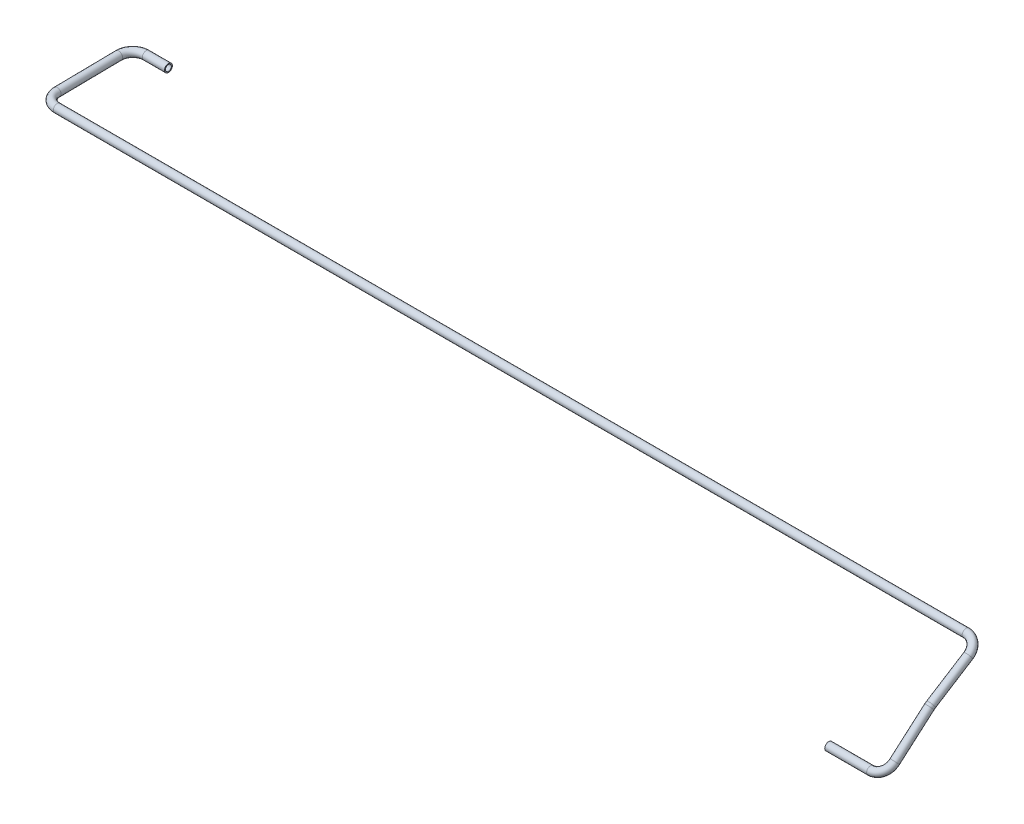
ISO-10303-21;
HEADER;
FILE_DESCRIPTION(('STEP AP214'),'2;1');
FILE_NAME('part.step','',(''),(''),'','','');
FILE_SCHEMA(('AUTOMOTIVE_DESIGN { 1 0 10303 214 1 1 1 1 }'));
ENDSEC;
DATA;
#1=APPLICATION_CONTEXT('core data for automotive mechanical design processes');
#2=APPLICATION_PROTOCOL_DEFINITION('international standard','automotive_design',2000,#1);
#3=PRODUCT_CONTEXT('',#1,'mechanical');
#4=PRODUCT('Part','Part','',(#3));
#5=PRODUCT_RELATED_PRODUCT_CATEGORY('part','',(#4));
#6=PRODUCT_DEFINITION_FORMATION('','',#4);
#7=PRODUCT_DEFINITION_CONTEXT('part definition',#1,'design');
#8=PRODUCT_DEFINITION('design','',#6,#7);
#9=PRODUCT_DEFINITION_SHAPE('','',#8);
#10=(LENGTH_UNIT() NAMED_UNIT(*) SI_UNIT(.MILLI.,.METRE.));
#11=(NAMED_UNIT(*) PLANE_ANGLE_UNIT() SI_UNIT($,.RADIAN.));
#12=(NAMED_UNIT(*) SI_UNIT($,.STERADIAN.) SOLID_ANGLE_UNIT());
#13=UNCERTAINTY_MEASURE_WITH_UNIT(LENGTH_MEASURE(1.E-05),#10,'distance_accuracy_value','');
#14=(GEOMETRIC_REPRESENTATION_CONTEXT(3) GLOBAL_UNCERTAINTY_ASSIGNED_CONTEXT((#13)) GLOBAL_UNIT_ASSIGNED_CONTEXT((#10,
#11,#12)) REPRESENTATION_CONTEXT('',''));
#15=CARTESIAN_POINT('',(0.,0.,0.));
#16=DIRECTION('',(0.,0.,1.));
#17=DIRECTION('',(1.,0.,0.));
#18=AXIS2_PLACEMENT_3D('',#15,#16,#17);
#19=CARTESIAN_POINT('',(-1325.,111.,-282.));
#20=DIRECTION('',(1.,0.,0.));
#21=DIRECTION('',(0.,0.,-1.));
#22=AXIS2_PLACEMENT_3D('',#19,#20,#21);
#23=CYLINDRICAL_SURFACE('',#22,6.);
#24=CARTESIAN_POINT('',(-1325.,111.,-282.));
#25=DIRECTION('',(1.,0.,0.));
#26=DIRECTION('',(0.,-0.94920834607925,-0.314648241268716));
#27=AXIS2_PLACEMENT_3D('',#24,#25,#26);
#28=CIRCLE('',#27,6.);
#29=CARTESIAN_POINT('',(-1325.,111.088225754651,-287.999351316285));
#30=VERTEX_POINT('',#29);
#31=EDGE_CURVE('E51',#30,#30,#28,.T.);
#32=ORIENTED_EDGE('',*,*,#31,.T.);
#33=EDGE_LOOP('',(#32));
#34=FACE_BOUND('',#33,.T.);
#35=CARTESIAN_POINT('',(-1291.,111.,-282.));
#36=DIRECTION('',(1.,0.,0.));
#37=DIRECTION('',(0.,-0.94920834607925,-0.314648241268716));
#38=AXIS2_PLACEMENT_3D('',#35,#36,#37);
#39=CIRCLE('',#38,6.);
#40=CARTESIAN_POINT('',(-1291.,105.304749923524,-283.887889447612));
#41=VERTEX_POINT('',#40);
#42=EDGE_CURVE('E10',#41,#41,#39,.T.);
#43=ORIENTED_EDGE('',*,*,#42,.F.);
#44=EDGE_LOOP('',(#43));
#45=FACE_BOUND('',#44,.T.);
#46=ADVANCED_FACE('F41',(#34,#45),#23,.T.);
#47=CARTESIAN_POINT('',(-1325.,111.,-282.));
#48=DIRECTION('',(1.,0.,0.));
#49=DIRECTION('',(0.,0.,-1.));
#50=AXIS2_PLACEMENT_3D('',#47,#48,#49);
#51=CYLINDRICAL_SURFACE('',#50,4.5);
#52=CARTESIAN_POINT('',(-1325.,111.,-282.));
#53=DIRECTION('',(1.,0.,0.));
#54=DIRECTION('',(0.,-0.94920834607925,-0.314648241268716));
#55=AXIS2_PLACEMENT_3D('',#52,#53,#54);
#56=CIRCLE('',#55,4.5);
#57=CARTESIAN_POINT('',(-1325.,111.066169315988,-286.499513487214));
#58=VERTEX_POINT('',#57);
#59=EDGE_CURVE('E55',#58,#58,#56,.T.);
#60=ORIENTED_EDGE('',*,*,#59,.F.);
#61=EDGE_LOOP('',(#60));
#62=FACE_BOUND('',#61,.T.);
#63=CARTESIAN_POINT('',(-1291.,111.,-282.));
#64=DIRECTION('',(1.,0.,0.));
#65=DIRECTION('',(0.,-0.94920834607925,-0.314648241268716));
#66=AXIS2_PLACEMENT_3D('',#63,#64,#65);
#67=CIRCLE('',#66,4.5);
#68=CARTESIAN_POINT('',(-1291.,106.728562442643,-283.415917085709));
#69=VERTEX_POINT('',#68);
#70=EDGE_CURVE('E47',#69,#69,#67,.T.);
#71=ORIENTED_EDGE('',*,*,#70,.T.);
#72=EDGE_LOOP('',(#71));
#73=FACE_BOUND('',#72,.T.);
#74=ADVANCED_FACE('F187',(#62,#73),#51,.F.);
#75=CARTESIAN_POINT('',(-1325.,110.691209858721,-261.002270393001));
#76=DIRECTION('',(0.,-0.999891886047579,-0.0147042924418753));
#77=DIRECTION('',(0.,0.0147042924418753,-0.999891886047579));
#78=AXIS2_PLACEMENT_3D('',#75,#76,#77);
#79=TOROIDAL_SURFACE('',#78,20.9999999999999,6.);
#80=CARTESIAN_POINT('',(-1346.,110.691209858721,-261.002270393001));
#81=DIRECTION('',(0.,0.0147042924418707,-0.999891886047579));
#82=DIRECTION('',(-0.300656786294711,-0.953629291389562,-0.0140239601674898));
#83=AXIS2_PLACEMENT_3D('',#80,#81,#82);
#84=CIRCLE('',#83,6.);
#85=CARTESIAN_POINT('',(-1352.,110.691209858721,-261.002270393001));
#86=VERTEX_POINT('',#85);
#87=EDGE_CURVE('E60',#86,#86,#84,.T.);
#88=CARTESIAN_POINT('',(-1325.,110.691209858721,-261.002270393001));
#89=DIRECTION('',(0.,-0.999891886047579,-0.0147042924418753));
#90=DIRECTION('',(0.,0.0147042924418753,-0.999891886047579));
#91=AXIS2_PLACEMENT_3D('',#88,#89,#90);
#92=CIRCLE('',#91,26.9999999999999);
#93=EDGE_CURVE('',#86,#30,#92,.T.);
#94=ORIENTED_EDGE('',*,*,#87,.T.);
#95=ORIENTED_EDGE('',*,*,#31,.F.);
#96=ORIENTED_EDGE('',*,*,#93,.T.);
#97=ORIENTED_EDGE('',*,*,#93,.F.);
#98=EDGE_LOOP('',(#94,#96,#95,#97));
#99=FACE_BOUND('',#98,.T.);
#100=ADVANCED_FACE('F183',(#99),#79,.T.);
#101=CARTESIAN_POINT('',(-1325.,110.691209858721,-261.002270393001));
#102=DIRECTION('',(0.,-0.999891886047579,-0.0147042924418753));
#103=DIRECTION('',(0.,0.0147042924418753,-0.999891886047579));
#104=AXIS2_PLACEMENT_3D('',#101,#102,#103);
#105=TOROIDAL_SURFACE('',#104,20.9999999999999,4.5);
#106=CARTESIAN_POINT('',(-1346.,110.691209858721,-261.002270393001));
#107=DIRECTION('',(0.,0.0147042924418707,-0.999891886047579));
#108=DIRECTION('',(-0.300656786294711,-0.953629291389562,-0.0140239601674898));
#109=AXIS2_PLACEMENT_3D('',#106,#107,#108);
#110=CIRCLE('',#109,4.5);
#111=CARTESIAN_POINT('',(-1350.5,110.691209858721,-261.002270393001));
#112=VERTEX_POINT('',#111);
#113=EDGE_CURVE('E63',#112,#112,#110,.T.);
#114=CARTESIAN_POINT('',(-1325.,110.691209858721,-261.002270393001));
#115=DIRECTION('',(0.,-0.999891886047579,-0.0147042924418753));
#116=DIRECTION('',(0.,0.0147042924418753,-0.999891886047579));
#117=AXIS2_PLACEMENT_3D('',#114,#115,#116);
#118=CIRCLE('',#117,25.4999999999999);
#119=EDGE_CURVE('',#112,#58,#118,.T.);
#120=ORIENTED_EDGE('',*,*,#113,.F.);
#121=ORIENTED_EDGE('',*,*,#59,.T.);
#122=ORIENTED_EDGE('',*,*,#119,.T.);
#123=ORIENTED_EDGE('',*,*,#119,.F.);
#124=EDGE_LOOP('',(#120,#122,#121,#123));
#125=FACE_BOUND('',#124,.T.);
#126=ADVANCED_FACE('F180',(#125),#105,.F.);
#127=CARTESIAN_POINT('',(-1346.,109.308790141279,-166.997729606999));
#128=DIRECTION('',(0.,0.0147042924418766,-0.999891886047579));
#129=DIRECTION('',(0.,0.999891886047579,0.0147042924418766));
#130=AXIS2_PLACEMENT_3D('',#127,#128,#129);
#131=CYLINDRICAL_SURFACE('',#130,6.);
#132=CARTESIAN_POINT('',(-1346.,109.308790141279,-166.997729606999));
#133=DIRECTION('',(0.,0.0147042924418707,-0.999891886047579));
#134=DIRECTION('',(-0.300656786294711,-0.953629291389562,-0.0140239601674898));
#135=AXIS2_PLACEMENT_3D('',#132,#133,#134);
#136=CIRCLE('',#135,6.);
#137=CARTESIAN_POINT('',(-1352.,109.308790141279,-166.997729606999));
#138=VERTEX_POINT('',#137);
#139=EDGE_CURVE('E66',#138,#138,#136,.T.);
#140=ORIENTED_EDGE('',*,*,#139,.T.);
#141=EDGE_LOOP('',(#140));
#142=FACE_BOUND('',#141,.T.);
#143=ORIENTED_EDGE('',*,*,#87,.F.);
#144=EDGE_LOOP('',(#143));
#145=FACE_BOUND('',#144,.T.);
#146=ADVANCED_FACE('F176',(#142,#145),#131,.T.);
#147=CARTESIAN_POINT('',(-1346.,109.308790141279,-166.997729606999));
#148=DIRECTION('',(0.,0.0147042924418766,-0.999891886047579));
#149=DIRECTION('',(0.,0.999891886047579,0.0147042924418766));
#150=AXIS2_PLACEMENT_3D('',#147,#148,#149);
#151=CYLINDRICAL_SURFACE('',#150,4.5);
#152=CARTESIAN_POINT('',(-1346.,109.308790141279,-166.997729606999));
#153=DIRECTION('',(0.,0.0147042924418707,-0.999891886047579));
#154=DIRECTION('',(-0.300656786294711,-0.953629291389562,-0.0140239601674898));
#155=AXIS2_PLACEMENT_3D('',#152,#153,#154);
#156=CIRCLE('',#155,4.5);
#157=CARTESIAN_POINT('',(-1350.5,109.308790141279,-166.997729606999));
#158=VERTEX_POINT('',#157);
#159=EDGE_CURVE('E69',#158,#158,#156,.T.);
#160=ORIENTED_EDGE('',*,*,#159,.F.);
#161=EDGE_LOOP('',(#160));
#162=FACE_BOUND('',#161,.T.);
#163=ORIENTED_EDGE('',*,*,#113,.T.);
#164=EDGE_LOOP('',(#163));
#165=FACE_BOUND('',#164,.T.);
#166=ADVANCED_FACE('F173',(#162,#165),#151,.F.);
#167=CARTESIAN_POINT('',(-1325.,109.308790141279,-166.997729606999));
#168=DIRECTION('',(0.,-0.999891886047579,-0.0147042924418766));
#169=DIRECTION('',(0.,0.0147042924418766,-0.999891886047579));
#170=AXIS2_PLACEMENT_3D('',#167,#168,#169);
#171=TOROIDAL_SURFACE('',#170,21.,6.);
#172=CARTESIAN_POINT('',(-1325.,109.,-146.));
#173=DIRECTION('',(-1.,0.,0.));
#174=DIRECTION('',(0.,-0.958050236699874,0.286600320933729));
#175=AXIS2_PLACEMENT_3D('',#172,#173,#174);
#176=CIRCLE('',#175,6.);
#177=CARTESIAN_POINT('',(-1325.,108.911774245349,-140.000648683714));
#178=VERTEX_POINT('',#177);
#179=EDGE_CURVE('E72',#178,#178,#176,.T.);
#180=CARTESIAN_POINT('',(-1325.,109.308790141279,-166.997729606999));
#181=DIRECTION('',(0.,-0.999891886047579,-0.0147042924418766));
#182=DIRECTION('',(0.,0.0147042924418766,-0.999891886047579));
#183=AXIS2_PLACEMENT_3D('',#180,#181,#182);
#184=CIRCLE('',#183,27.);
#185=EDGE_CURVE('',#178,#138,#184,.T.);
#186=ORIENTED_EDGE('',*,*,#179,.T.);
#187=ORIENTED_EDGE('',*,*,#139,.F.);
#188=ORIENTED_EDGE('',*,*,#185,.T.);
#189=ORIENTED_EDGE('',*,*,#185,.F.);
#190=EDGE_LOOP('',(#186,#188,#187,#189));
#191=FACE_BOUND('',#190,.T.);
#192=ADVANCED_FACE('F169',(#191),#171,.T.);
#193=CARTESIAN_POINT('',(-1325.,109.308790141279,-166.997729606999));
#194=DIRECTION('',(0.,-0.999891886047579,-0.0147042924418766));
#195=DIRECTION('',(0.,0.0147042924418766,-0.999891886047579));
#196=AXIS2_PLACEMENT_3D('',#193,#194,#195);
#197=TOROIDAL_SURFACE('',#196,21.,4.5);
#198=CARTESIAN_POINT('',(-1325.,109.,-146.));
#199=DIRECTION('',(-1.,0.,0.));
#200=DIRECTION('',(0.,-0.958050236699874,0.286600320933729));
#201=AXIS2_PLACEMENT_3D('',#198,#199,#200);
#202=CIRCLE('',#201,4.5);
#203=CARTESIAN_POINT('',(-1325.,108.933830684012,-141.500486512786));
#204=VERTEX_POINT('',#203);
#205=EDGE_CURVE('E75',#204,#204,#202,.T.);
#206=CARTESIAN_POINT('',(-1325.,109.308790141279,-166.997729606999));
#207=DIRECTION('',(0.,-0.999891886047579,-0.0147042924418766));
#208=DIRECTION('',(0.,0.0147042924418766,-0.999891886047579));
#209=AXIS2_PLACEMENT_3D('',#206,#207,#208);
#210=CIRCLE('',#209,25.5);
#211=EDGE_CURVE('',#204,#158,#210,.T.);
#212=ORIENTED_EDGE('',*,*,#205,.F.);
#213=ORIENTED_EDGE('',*,*,#159,.T.);
#214=ORIENTED_EDGE('',*,*,#211,.T.);
#215=ORIENTED_EDGE('',*,*,#211,.F.);
#216=EDGE_LOOP('',(#212,#214,#213,#215));
#217=FACE_BOUND('',#216,.T.);
#218=ADVANCED_FACE('F166',(#217),#197,.F.);
#219=CARTESIAN_POINT('',(64.,109.,-146.));
#220=DIRECTION('',(-1.,0.,0.));
#221=DIRECTION('',(0.,0.,1.));
#222=AXIS2_PLACEMENT_3D('',#219,#220,#221);
#223=CYLINDRICAL_SURFACE('',#222,6.);
#224=CARTESIAN_POINT('',(64.,109.,-146.));
#225=DIRECTION('',(-1.,0.,0.));
#226=DIRECTION('',(0.,-0.958050236699874,0.286600320933729));
#227=AXIS2_PLACEMENT_3D('',#224,#225,#226);
#228=CIRCLE('',#227,6.);
#229=CARTESIAN_POINT('',(64.,112.203957948328,-151.072933418186));
#230=VERTEX_POINT('',#229);
#231=EDGE_CURVE('E78',#230,#230,#228,.T.);
#232=ORIENTED_EDGE('',*,*,#231,.T.);
#233=EDGE_LOOP('',(#232));
#234=FACE_BOUND('',#233,.T.);
#235=ORIENTED_EDGE('',*,*,#179,.F.);
#236=EDGE_LOOP('',(#235));
#237=FACE_BOUND('',#236,.T.);
#238=ADVANCED_FACE('F162',(#234,#237),#223,.T.);
#239=CARTESIAN_POINT('',(64.,109.,-146.));
#240=DIRECTION('',(-1.,0.,0.));
#241=DIRECTION('',(0.,0.,1.));
#242=AXIS2_PLACEMENT_3D('',#239,#240,#241);
#243=CYLINDRICAL_SURFACE('',#242,4.5);
#244=CARTESIAN_POINT('',(64.,109.,-146.));
#245=DIRECTION('',(-1.,0.,0.));
#246=DIRECTION('',(0.,-0.958050236699874,0.286600320933729));
#247=AXIS2_PLACEMENT_3D('',#244,#245,#246);
#248=CIRCLE('',#247,4.5);
#249=CARTESIAN_POINT('',(64.,111.402968461246,-149.804700063639));
#250=VERTEX_POINT('',#249);
#251=EDGE_CURVE('E81',#250,#250,#248,.T.);
#252=ORIENTED_EDGE('',*,*,#251,.F.);
#253=EDGE_LOOP('',(#252));
#254=FACE_BOUND('',#253,.T.);
#255=ORIENTED_EDGE('',*,*,#205,.T.);
#256=EDGE_LOOP('',(#255));
#257=FACE_BOUND('',#256,.T.);
#258=ADVANCED_FACE('F159',(#254,#257),#243,.F.);
#259=CARTESIAN_POINT('',(64.,97.7861471808524,-128.24473303635));
#260=DIRECTION('',(0.,0.845488903030971,0.533992991387982));
#261=DIRECTION('',(0.,-0.533992991387982,0.845488903030971));
#262=AXIS2_PLACEMENT_3D('',#259,#260,#261);
#263=TOROIDAL_SURFACE('',#262,21.,6.);
#264=CARTESIAN_POINT('',(85.,97.7861471808524,-128.24473303635));
#265=DIRECTION('',(0.,0.533992991387976,-0.845488903030975));
#266=DIRECTION('',(-0.753909502749912,-0.555467846090624,-0.350821797530915));
#267=AXIS2_PLACEMENT_3D('',#264,#265,#266);
#268=CIRCLE('',#267,6.);
#269=CARTESIAN_POINT('',(91.,97.7861471808524,-128.24473303635));
#270=VERTEX_POINT('',#269);
#271=EDGE_CURVE('E84',#270,#270,#268,.T.);
#272=CARTESIAN_POINT('',(64.,97.7861471808524,-128.24473303635));
#273=DIRECTION('',(0.,0.845488903030971,0.533992991387982));
#274=DIRECTION('',(0.,-0.533992991387982,0.845488903030971));
#275=AXIS2_PLACEMENT_3D('',#272,#273,#274);
#276=CIRCLE('',#275,27.);
#277=EDGE_CURVE('',#270,#230,#276,.T.);
#278=ORIENTED_EDGE('',*,*,#271,.T.);
#279=ORIENTED_EDGE('',*,*,#231,.F.);
#280=ORIENTED_EDGE('',*,*,#277,.T.);
#281=ORIENTED_EDGE('',*,*,#277,.F.);
#282=EDGE_LOOP('',(#278,#280,#279,#281));
#283=FACE_BOUND('',#282,.T.);
#284=ADVANCED_FACE('F155',(#283),#263,.T.);
#285=CARTESIAN_POINT('',(64.,97.7861471808524,-128.24473303635));
#286=DIRECTION('',(0.,0.845488903030971,0.533992991387982));
#287=DIRECTION('',(0.,-0.533992991387982,0.845488903030971));
#288=AXIS2_PLACEMENT_3D('',#285,#286,#287);
#289=TOROIDAL_SURFACE('',#288,21.,4.5);
#290=CARTESIAN_POINT('',(85.,97.7861471808524,-128.24473303635));
#291=DIRECTION('',(0.,0.533992991387976,-0.845488903030975));
#292=DIRECTION('',(-0.753909502749912,-0.555467846090624,-0.350821797530915));
#293=AXIS2_PLACEMENT_3D('',#290,#291,#292);
#294=CIRCLE('',#293,4.5);
#295=CARTESIAN_POINT('',(89.5,97.7861471808524,-128.24473303635));
#296=VERTEX_POINT('',#295);
#297=EDGE_CURVE('E87',#296,#296,#294,.T.);
#298=CARTESIAN_POINT('',(64.,97.7861471808524,-128.24473303635));
#299=DIRECTION('',(0.,0.845488903030971,0.533992991387982));
#300=DIRECTION('',(0.,-0.533992991387982,0.845488903030971));
#301=AXIS2_PLACEMENT_3D('',#298,#299,#300);
#302=CIRCLE('',#301,25.5);
#303=EDGE_CURVE('',#296,#250,#302,.T.);
#304=ORIENTED_EDGE('',*,*,#297,.F.);
#305=ORIENTED_EDGE('',*,*,#251,.T.);
#306=ORIENTED_EDGE('',*,*,#303,.T.);
#307=ORIENTED_EDGE('',*,*,#303,.F.);
#308=EDGE_LOOP('',(#304,#306,#305,#307));
#309=FACE_BOUND('',#308,.T.);
#310=ADVANCED_FACE('F152',(#309),#289,.F.);
#311=CARTESIAN_POINT('',(85.,61.8622860516075,-71.3652862483786));
#312=DIRECTION('',(0.,0.533992991387982,-0.845488903030971));
#313=DIRECTION('',(0.,0.845488903030971,0.533992991387982));
#314=AXIS2_PLACEMENT_3D('',#311,#312,#313);
#315=CYLINDRICAL_SURFACE('',#314,6.);
#316=CARTESIAN_POINT('',(85.,61.8622860516075,-71.3652862483786));
#317=DIRECTION('',(0.,0.533992991387976,-0.845488903030975));
#318=DIRECTION('',(-0.753909502749912,-0.555467846090624,-0.350821797530915));
#319=AXIS2_PLACEMENT_3D('',#316,#317,#318);
#320=CIRCLE('',#319,6.);
#321=CARTESIAN_POINT('',(85.,66.9352194697934,-68.1613283000507));
#322=VERTEX_POINT('',#321);
#323=EDGE_CURVE('E90',#322,#322,#320,.T.);
#324=ORIENTED_EDGE('',*,*,#323,.T.);
#325=EDGE_LOOP('',(#324));
#326=FACE_BOUND('',#325,.T.);
#327=ORIENTED_EDGE('',*,*,#271,.F.);
#328=EDGE_LOOP('',(#327));
#329=FACE_BOUND('',#328,.T.);
#330=ADVANCED_FACE('F148',(#326,#329),#315,.T.);
#331=CARTESIAN_POINT('',(85.,61.8622860516075,-71.3652862483786));
#332=DIRECTION('',(0.,0.533992991387982,-0.845488903030971));
#333=DIRECTION('',(0.,0.845488903030971,0.533992991387982));
#334=AXIS2_PLACEMENT_3D('',#331,#332,#333);
#335=CYLINDRICAL_SURFACE('',#334,4.5);
#336=CARTESIAN_POINT('',(85.,61.8622860516075,-71.3652862483786));
#337=DIRECTION('',(0.,0.533992991387976,-0.845488903030975));
#338=DIRECTION('',(-0.753909502749912,-0.555467846090624,-0.350821797530915));
#339=AXIS2_PLACEMENT_3D('',#336,#337,#338);
#340=CIRCLE('',#339,4.5);
#341=CARTESIAN_POINT('',(85.,65.6669861152469,-68.9623177871327));
#342=VERTEX_POINT('',#341);
#343=EDGE_CURVE('E93',#342,#342,#340,.T.);
#344=ORIENTED_EDGE('',*,*,#343,.F.);
#345=EDGE_LOOP('',(#344));
#346=FACE_BOUND('',#345,.T.);
#347=ORIENTED_EDGE('',*,*,#297,.T.);
#348=EDGE_LOOP('',(#347));
#349=FACE_BOUND('',#348,.T.);
#350=ADVANCED_FACE('F145',(#346,#349),#335,.F.);
#351=CARTESIAN_POINT('',(85.,44.1070190879571,-82.5791390675261));
#352=DIRECTION('',(-1.,0.,0.));
#353=DIRECTION('',(0.,0.,1.));
#354=AXIS2_PLACEMENT_3D('',#351,#352,#353);
#355=TOROIDAL_SURFACE('',#354,21.,6.);
#356=CARTESIAN_POINT('',(85.,59.9391186457052,-68.7825951672027));
#357=DIRECTION('',(0.,0.656978280967781,-0.753909502749912));
#358=DIRECTION('',(-0.753909502749912,-0.495302169121912,-0.43162046166338));
#359=AXIS2_PLACEMENT_3D('',#356,#357,#358);
#360=CIRCLE('',#359,6.);
#361=CARTESIAN_POINT('',(85.,64.4625756622047,-64.840725481396));
#362=VERTEX_POINT('',#361);
#363=EDGE_CURVE('E96',#362,#362,#360,.T.);
#364=CARTESIAN_POINT('',(85.,44.1070190879571,-82.5791390675261));
#365=DIRECTION('',(-1.,0.,0.));
#366=DIRECTION('',(0.,0.,1.));
#367=AXIS2_PLACEMENT_3D('',#364,#365,#366);
#368=CIRCLE('',#367,27.);
#369=EDGE_CURVE('',#362,#322,#368,.T.);
#370=ORIENTED_EDGE('',*,*,#363,.T.);
#371=ORIENTED_EDGE('',*,*,#323,.F.);
#372=ORIENTED_EDGE('',*,*,#369,.T.);
#373=ORIENTED_EDGE('',*,*,#369,.F.);
#374=EDGE_LOOP('',(#370,#372,#371,#373));
#375=FACE_BOUND('',#374,.T.);
#376=ADVANCED_FACE('F141',(#375),#355,.T.);
#377=CARTESIAN_POINT('',(85.,44.1070190879571,-82.5791390675261));
#378=DIRECTION('',(-1.,0.,0.));
#379=DIRECTION('',(0.,0.,1.));
#380=AXIS2_PLACEMENT_3D('',#377,#378,#379);
#381=TOROIDAL_SURFACE('',#380,21.,4.5);
#382=CARTESIAN_POINT('',(85.,59.9391186457052,-68.7825951672027));
#383=DIRECTION('',(0.,0.656978280967781,-0.753909502749912));
#384=DIRECTION('',(-0.753909502749912,-0.495302169121912,-0.43162046166338));
#385=AXIS2_PLACEMENT_3D('',#382,#383,#384);
#386=CIRCLE('',#385,4.5);
#387=CARTESIAN_POINT('',(85.,63.3317114080798,-65.8261929028477));
#388=VERTEX_POINT('',#387);
#389=EDGE_CURVE('E99',#388,#388,#386,.T.);
#390=CARTESIAN_POINT('',(85.,44.1070190879571,-82.5791390675261));
#391=DIRECTION('',(-1.,0.,0.));
#392=DIRECTION('',(0.,0.,1.));
#393=AXIS2_PLACEMENT_3D('',#390,#391,#392);
#394=CIRCLE('',#393,25.5);
#395=EDGE_CURVE('',#388,#342,#394,.T.);
#396=ORIENTED_EDGE('',*,*,#389,.F.);
#397=ORIENTED_EDGE('',*,*,#343,.T.);
#398=ORIENTED_EDGE('',*,*,#395,.T.);
#399=ORIENTED_EDGE('',*,*,#395,.F.);
#400=EDGE_LOOP('',(#396,#398,#397,#399));
#401=FACE_BOUND('',#400,.T.);
#402=ADVANCED_FACE('F138',(#401),#381,.F.);
#403=CARTESIAN_POINT('',(85.,13.7965439003234,-15.8320995577482));
#404=DIRECTION('',(0.,0.656978280967781,-0.753909502749912));
#405=DIRECTION('',(0.,0.753909502749912,0.656978280967781));
#406=AXIS2_PLACEMENT_3D('',#403,#404,#405);
#407=CYLINDRICAL_SURFACE('',#406,6.);
#408=CARTESIAN_POINT('',(85.,13.7965439003234,-15.8320995577482));
#409=DIRECTION('',(0.,0.656978280967781,-0.753909502749912));
#410=DIRECTION('',(-0.753909502749912,-0.495302169121912,-0.43162046166338));
#411=AXIS2_PLACEMENT_3D('',#408,#409,#410);
#412=CIRCLE('',#411,6.);
#413=CARTESIAN_POINT('',(91.,13.7965439003234,-15.8320995577482));
#414=VERTEX_POINT('',#413);
#415=EDGE_CURVE('E102',#414,#414,#412,.T.);
#416=ORIENTED_EDGE('',*,*,#415,.T.);
#417=EDGE_LOOP('',(#416));
#418=FACE_BOUND('',#417,.T.);
#419=ORIENTED_EDGE('',*,*,#363,.F.);
#420=EDGE_LOOP('',(#419));
#421=FACE_BOUND('',#420,.T.);
#422=ADVANCED_FACE('F134',(#418,#421),#407,.T.);
#423=CARTESIAN_POINT('',(85.,13.7965439003234,-15.8320995577482));
#424=DIRECTION('',(0.,0.656978280967781,-0.753909502749912));
#425=DIRECTION('',(0.,0.753909502749912,0.656978280967781));
#426=AXIS2_PLACEMENT_3D('',#423,#424,#425);
#427=CYLINDRICAL_SURFACE('',#426,4.5);
#428=CARTESIAN_POINT('',(85.,13.7965439003234,-15.8320995577482));
#429=DIRECTION('',(0.,0.656978280967781,-0.753909502749912));
#430=DIRECTION('',(-0.753909502749912,-0.495302169121912,-0.43162046166338));
#431=AXIS2_PLACEMENT_3D('',#428,#429,#430);
#432=CIRCLE('',#431,4.5);
#433=CARTESIAN_POINT('',(89.5,13.7965439003234,-15.8320995577482));
#434=VERTEX_POINT('',#433);
#435=EDGE_CURVE('E105',#434,#434,#432,.T.);
#436=ORIENTED_EDGE('',*,*,#435,.F.);
#437=EDGE_LOOP('',(#436));
#438=FACE_BOUND('',#437,.T.);
#439=ORIENTED_EDGE('',*,*,#389,.T.);
#440=EDGE_LOOP('',(#439));
#441=FACE_BOUND('',#440,.T.);
#442=ADVANCED_FACE('F131',(#438,#441),#427,.F.);
#443=CARTESIAN_POINT('',(64.,13.7965439003234,-15.8320995577482));
#444=DIRECTION('',(0.,0.753909502749912,0.656978280967781));
#445=DIRECTION('',(0.,-0.656978280967781,0.753909502749912));
#446=AXIS2_PLACEMENT_3D('',#443,#444,#445);
#447=TOROIDAL_SURFACE('',#446,21.,6.);
#448=CARTESIAN_POINT('',(64.,0.,0.));
#449=DIRECTION('',(1.,0.,0.));
#450=DIRECTION('',(0.,0.,-1.));
#451=AXIS2_PLACEMENT_3D('',#448,#449,#450);
#452=CIRCLE('',#451,6.);
#453=CARTESIAN_POINT('',(64.,-3.94186968580668,4.52345701649948));
#454=VERTEX_POINT('',#453);
#455=EDGE_CURVE('E108',#454,#454,#452,.T.);
#456=CARTESIAN_POINT('',(64.,13.7965439003234,-15.8320995577482));
#457=DIRECTION('',(0.,0.753909502749912,0.656978280967781));
#458=DIRECTION('',(0.,-0.656978280967781,0.753909502749912));
#459=AXIS2_PLACEMENT_3D('',#456,#457,#458);
#460=CIRCLE('',#459,27.);
#461=EDGE_CURVE('',#454,#414,#460,.T.);
#462=ORIENTED_EDGE('',*,*,#455,.T.);
#463=ORIENTED_EDGE('',*,*,#415,.F.);
#464=ORIENTED_EDGE('',*,*,#461,.T.);
#465=ORIENTED_EDGE('',*,*,#461,.F.);
#466=EDGE_LOOP('',(#462,#464,#463,#465));
#467=FACE_BOUND('',#466,.T.);
#468=ADVANCED_FACE('F127',(#467),#447,.T.);
#469=CARTESIAN_POINT('',(64.,13.7965439003234,-15.8320995577482));
#470=DIRECTION('',(0.,0.753909502749912,0.656978280967781));
#471=DIRECTION('',(0.,-0.656978280967781,0.753909502749912));
#472=AXIS2_PLACEMENT_3D('',#469,#470,#471);
#473=TOROIDAL_SURFACE('',#472,21.,4.5);
#474=CARTESIAN_POINT('',(64.,0.,0.));
#475=DIRECTION('',(1.,0.,0.));
#476=DIRECTION('',(0.,0.,-1.));
#477=AXIS2_PLACEMENT_3D('',#474,#475,#476);
#478=CIRCLE('',#477,4.5);
#479=CARTESIAN_POINT('',(64.,-2.95640226435501,3.3925927623746));
#480=VERTEX_POINT('',#479);
#481=EDGE_CURVE('E112',#480,#480,#478,.T.);
#482=CARTESIAN_POINT('',(64.,13.7965439003234,-15.8320995577482));
#483=DIRECTION('',(0.,0.753909502749912,0.656978280967781));
#484=DIRECTION('',(0.,-0.656978280967781,0.753909502749912));
#485=AXIS2_PLACEMENT_3D('',#482,#483,#484);
#486=CIRCLE('',#485,25.5);
#487=EDGE_CURVE('',#480,#434,#486,.T.);
#488=ORIENTED_EDGE('',*,*,#481,.F.);
#489=ORIENTED_EDGE('',*,*,#435,.T.);
#490=ORIENTED_EDGE('',*,*,#487,.T.);
#491=ORIENTED_EDGE('',*,*,#487,.F.);
#492=EDGE_LOOP('',(#488,#490,#489,#491));
#493=FACE_BOUND('',#492,.T.);
#494=ADVANCED_FACE('F124',(#493),#473,.F.);
#495=CARTESIAN_POINT('',(64.,0.,0.));
#496=DIRECTION('',(-1.,0.,0.));
#497=DIRECTION('',(0.,0.,1.));
#498=AXIS2_PLACEMENT_3D('',#495,#496,#497);
#499=CYLINDRICAL_SURFACE('',#498,4.5);
#500=ORIENTED_EDGE('',*,*,#481,.T.);
#501=EDGE_LOOP('',(#500));
#502=FACE_BOUND('',#501,.T.);
#503=CARTESIAN_POINT('',(0.,0.,0.));
#504=DIRECTION('',(1.,0.,0.));
#505=DIRECTION('',(0.,0.,-1.));
#506=AXIS2_PLACEMENT_3D('',#503,#504,#505);
#507=CIRCLE('',#506,4.5);
#508=CARTESIAN_POINT('',(0.,0.,-4.5));
#509=VERTEX_POINT('',#508);
#510=EDGE_CURVE('E113',#509,#509,#507,.T.);
#511=ORIENTED_EDGE('',*,*,#510,.F.);
#512=EDGE_LOOP('',(#511));
#513=FACE_BOUND('',#512,.T.);
#514=ADVANCED_FACE('F121',(#502,#513),#499,.F.);
#515=CARTESIAN_POINT('',(64.,0.,0.));
#516=DIRECTION('',(-1.,0.,0.));
#517=DIRECTION('',(0.,0.,1.));
#518=AXIS2_PLACEMENT_3D('',#515,#516,#517);
#519=CYLINDRICAL_SURFACE('',#518,6.);
#520=ORIENTED_EDGE('',*,*,#455,.F.);
#521=EDGE_LOOP('',(#520));
#522=FACE_BOUND('',#521,.T.);
#523=CARTESIAN_POINT('',(0.,0.,0.));
#524=DIRECTION('',(1.,0.,0.));
#525=DIRECTION('',(0.,0.,-1.));
#526=AXIS2_PLACEMENT_3D('',#523,#524,#525);
#527=CIRCLE('',#526,6.);
#528=CARTESIAN_POINT('',(0.,0.,-6.));
#529=VERTEX_POINT('',#528);
#530=EDGE_CURVE('E109',#529,#529,#527,.T.);
#531=ORIENTED_EDGE('',*,*,#530,.T.);
#532=EDGE_LOOP('',(#531));
#533=FACE_BOUND('',#532,.T.);
#534=ADVANCED_FACE('F223',(#522,#533),#519,.T.);
#535=CARTESIAN_POINT('',(-1291.,111.,-282.));
#536=DIRECTION('',(1.,0.,0.));
#537=DIRECTION('',(0.,-0.94920834607925,-0.314648241268716));
#538=AXIS2_PLACEMENT_3D('',#535,#536,#537);
#539=PLANE('',#538);
#540=ORIENTED_EDGE('',*,*,#70,.F.);
#541=EDGE_LOOP('',(#540));
#542=FACE_BOUND('',#541,.T.);
#543=ORIENTED_EDGE('',*,*,#42,.T.);
#544=EDGE_LOOP('',(#543));
#545=FACE_BOUND('',#544,.T.);
#546=ADVANCED_FACE('F226',(#542,#545),#539,.T.);
#547=CARTESIAN_POINT('',(0.,0.,0.));
#548=DIRECTION('',(1.,0.,0.));
#549=DIRECTION('',(0.,0.,-1.));
#550=AXIS2_PLACEMENT_3D('',#547,#548,#549);
#551=PLANE('',#550);
#552=ORIENTED_EDGE('',*,*,#510,.T.);
#553=EDGE_LOOP('',(#552));
#554=FACE_BOUND('',#553,.T.);
#555=ORIENTED_EDGE('',*,*,#530,.F.);
#556=EDGE_LOOP('',(#555));
#557=FACE_BOUND('',#556,.T.);
#558=ADVANCED_FACE('F228',(#554,#557),#551,.F.);
#559=CLOSED_SHELL('',(#46,#74,#100,#126,#146,#166,#192,#218,#238,#258,#284,#310,#330,#350,#376,
#402,#422,#442,#468,#494,#514,#534,#546,#558));
#560=MANIFOLD_SOLID_BREP('B2',#559);
#561=ADVANCED_BREP_SHAPE_REPRESENTATION('',(#18,#560),#14);
#562=SHAPE_DEFINITION_REPRESENTATION(#9,#561);
ENDSEC;
END-ISO-10303-21;
